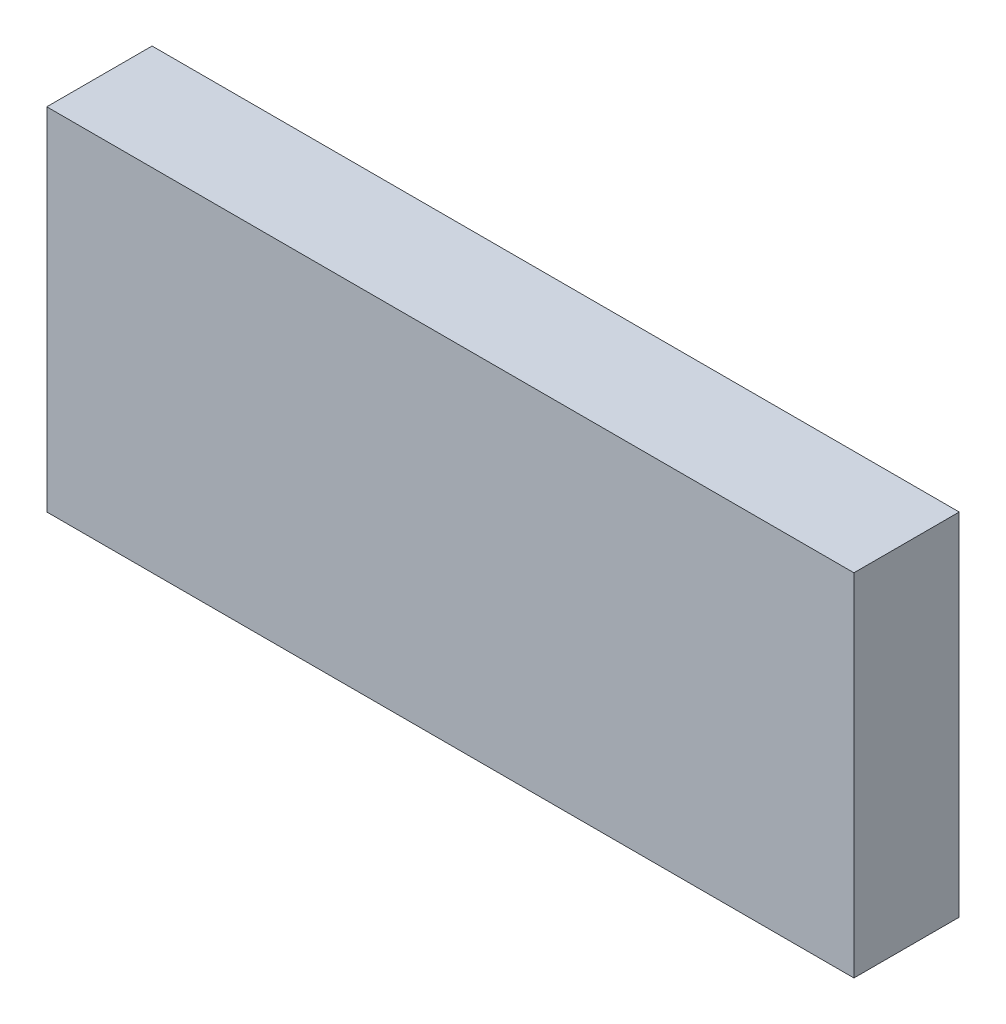
ISO-10303-21;
HEADER;
FILE_DESCRIPTION(('STEP AP214'),'2;1');
FILE_NAME('part.step','',(''),(''),'','','');
FILE_SCHEMA(('AUTOMOTIVE_DESIGN { 1 0 10303 214 1 1 1 1 }'));
ENDSEC;
DATA;
#1=APPLICATION_CONTEXT('core data for automotive mechanical design processes');
#2=APPLICATION_PROTOCOL_DEFINITION('international standard','automotive_design',2000,#1);
#3=PRODUCT_CONTEXT('',#1,'mechanical');
#4=PRODUCT('Part','Part','',(#3));
#5=PRODUCT_RELATED_PRODUCT_CATEGORY('part','',(#4));
#6=PRODUCT_DEFINITION_FORMATION('','',#4);
#7=PRODUCT_DEFINITION_CONTEXT('part definition',#1,'design');
#8=PRODUCT_DEFINITION('design','',#6,#7);
#9=PRODUCT_DEFINITION_SHAPE('','',#8);
#10=(LENGTH_UNIT() NAMED_UNIT(*) SI_UNIT(.MILLI.,.METRE.));
#11=(NAMED_UNIT(*) PLANE_ANGLE_UNIT() SI_UNIT($,.RADIAN.));
#12=(NAMED_UNIT(*) SI_UNIT($,.STERADIAN.) SOLID_ANGLE_UNIT());
#13=UNCERTAINTY_MEASURE_WITH_UNIT(LENGTH_MEASURE(1.E-05),#10,'distance_accuracy_value','');
#14=(GEOMETRIC_REPRESENTATION_CONTEXT(3) GLOBAL_UNCERTAINTY_ASSIGNED_CONTEXT((#13)) GLOBAL_UNIT_ASSIGNED_CONTEXT((#10,
#11,#12)) REPRESENTATION_CONTEXT('',''));
#15=CARTESIAN_POINT('',(0.,0.,0.));
#16=DIRECTION('',(0.,0.,1.));
#17=DIRECTION('',(1.,0.,0.));
#18=AXIS2_PLACEMENT_3D('',#15,#16,#17);
#19=CARTESIAN_POINT('',(-23.,10.,6.));
#20=DIRECTION('',(1.,0.,0.));
#21=DIRECTION('',(0.,1.,0.));
#22=AXIS2_PLACEMENT_3D('',#19,#20,#21);
#23=PLANE('',#22);
#24=DIRECTION('',(0.,-1.,0.));
#25=VECTOR('',#24,1.);
#26=CARTESIAN_POINT('',(-23.,10.,0.));
#27=LINE('',#26,#25);
#28=CARTESIAN_POINT('',(-23.,10.,0.));
#29=VERTEX_POINT('',#28);
#30=CARTESIAN_POINT('',(-23.,-10.,0.));
#31=VERTEX_POINT('',#30);
#32=EDGE_CURVE('E96',#29,#31,#27,.T.);
#33=ORIENTED_EDGE('',*,*,#32,.T.);
#34=DIRECTION('',(0.,0.,-1.));
#35=VECTOR('',#34,1.);
#36=CARTESIAN_POINT('',(-23.,-10.,6.));
#37=LINE('',#36,#35);
#38=CARTESIAN_POINT('',(-23.,-10.,6.));
#39=VERTEX_POINT('',#38);
#40=EDGE_CURVE('E11',#39,#31,#37,.T.);
#41=ORIENTED_EDGE('',*,*,#40,.F.);
#42=DIRECTION('',(0.,-1.,0.));
#43=VECTOR('',#42,1.);
#44=CARTESIAN_POINT('',(-23.,10.,6.));
#45=LINE('',#44,#43);
#46=CARTESIAN_POINT('',(-23.,10.,6.));
#47=VERTEX_POINT('',#46);
#48=EDGE_CURVE('E84',#47,#39,#45,.T.);
#49=ORIENTED_EDGE('',*,*,#48,.F.);
#50=DIRECTION('',(0.,0.,-1.));
#51=VECTOR('',#50,1.);
#52=CARTESIAN_POINT('',(-23.,10.,6.));
#53=LINE('',#52,#51);
#54=EDGE_CURVE('E92',#47,#29,#53,.T.);
#55=ORIENTED_EDGE('',*,*,#54,.T.);
#56=EDGE_LOOP('',(#33,#41,#49,#55));
#57=FACE_BOUND('',#56,.T.);
#58=ADVANCED_FACE('F33',(#57),#23,.F.);
#59=CARTESIAN_POINT('',(23.,-10.,6.));
#60=DIRECTION('',(0.,1.,0.));
#61=DIRECTION('',(-1.,0.,0.));
#62=AXIS2_PLACEMENT_3D('',#59,#60,#61);
#63=PLANE('',#62);
#64=DIRECTION('',(1.,0.,0.));
#65=VECTOR('',#64,1.);
#66=CARTESIAN_POINT('',(23.,-10.,0.));
#67=LINE('',#66,#65);
#68=CARTESIAN_POINT('',(23.,-10.,0.));
#69=VERTEX_POINT('',#68);
#70=EDGE_CURVE('E88',#31,#69,#67,.T.);
#71=ORIENTED_EDGE('',*,*,#70,.T.);
#72=DIRECTION('',(0.,0.,-1.));
#73=VECTOR('',#72,1.);
#74=CARTESIAN_POINT('',(23.,-10.,6.));
#75=LINE('',#74,#73);
#76=CARTESIAN_POINT('',(23.,-10.,6.));
#77=VERTEX_POINT('',#76);
#78=EDGE_CURVE('E41',#77,#69,#75,.T.);
#79=ORIENTED_EDGE('',*,*,#78,.F.);
#80=DIRECTION('',(1.,0.,0.));
#81=VECTOR('',#80,1.);
#82=CARTESIAN_POINT('',(23.,-10.,6.));
#83=LINE('',#82,#81);
#84=EDGE_CURVE('E79',#39,#77,#83,.T.);
#85=ORIENTED_EDGE('',*,*,#84,.F.);
#86=ORIENTED_EDGE('',*,*,#40,.T.);
#87=EDGE_LOOP('',(#71,#79,#85,#86));
#88=FACE_BOUND('',#87,.T.);
#89=ADVANCED_FACE('F87',(#88),#63,.F.);
#90=CARTESIAN_POINT('',(23.,10.,6.));
#91=DIRECTION('',(-1.,0.,0.));
#92=DIRECTION('',(0.,-1.,0.));
#93=AXIS2_PLACEMENT_3D('',#90,#91,#92);
#94=PLANE('',#93);
#95=DIRECTION('',(0.,1.,0.));
#96=VECTOR('',#95,1.);
#97=CARTESIAN_POINT('',(23.,10.,0.));
#98=LINE('',#97,#96);
#99=CARTESIAN_POINT('',(23.,10.,0.));
#100=VERTEX_POINT('',#99);
#101=EDGE_CURVE('E66',#69,#100,#98,.T.);
#102=ORIENTED_EDGE('',*,*,#101,.T.);
#103=DIRECTION('',(0.,0.,-1.));
#104=VECTOR('',#103,1.);
#105=CARTESIAN_POINT('',(23.,10.,6.));
#106=LINE('',#105,#104);
#107=CARTESIAN_POINT('',(23.,10.,6.));
#108=VERTEX_POINT('',#107);
#109=EDGE_CURVE('E89',#108,#100,#106,.T.);
#110=ORIENTED_EDGE('',*,*,#109,.F.);
#111=DIRECTION('',(0.,1.,0.));
#112=VECTOR('',#111,1.);
#113=CARTESIAN_POINT('',(23.,10.,6.));
#114=LINE('',#113,#112);
#115=EDGE_CURVE('E82',#77,#108,#114,.T.);
#116=ORIENTED_EDGE('',*,*,#115,.F.);
#117=ORIENTED_EDGE('',*,*,#78,.T.);
#118=EDGE_LOOP('',(#102,#110,#116,#117));
#119=FACE_BOUND('',#118,.T.);
#120=ADVANCED_FACE('F90',(#119),#94,.F.);
#121=CARTESIAN_POINT('',(23.,10.,6.));
#122=DIRECTION('',(0.,-1.,0.));
#123=DIRECTION('',(1.,0.,0.));
#124=AXIS2_PLACEMENT_3D('',#121,#122,#123);
#125=PLANE('',#124);
#126=DIRECTION('',(-1.,0.,0.));
#127=VECTOR('',#126,1.);
#128=CARTESIAN_POINT('',(23.,10.,0.));
#129=LINE('',#128,#127);
#130=EDGE_CURVE('E72',#100,#29,#129,.T.);
#131=ORIENTED_EDGE('',*,*,#130,.T.);
#132=ORIENTED_EDGE('',*,*,#54,.F.);
#133=DIRECTION('',(-1.,0.,0.));
#134=VECTOR('',#133,1.);
#135=CARTESIAN_POINT('',(23.,10.,6.));
#136=LINE('',#135,#134);
#137=EDGE_CURVE('E49',#108,#47,#136,.T.);
#138=ORIENTED_EDGE('',*,*,#137,.F.);
#139=ORIENTED_EDGE('',*,*,#109,.T.);
#140=EDGE_LOOP('',(#131,#132,#138,#139));
#141=FACE_BOUND('',#140,.T.);
#142=ADVANCED_FACE('F103',(#141),#125,.F.);
#143=CARTESIAN_POINT('',(0.,0.,6.));
#144=DIRECTION('',(0.,0.,-1.));
#145=DIRECTION('',(-1.,0.,0.));
#146=AXIS2_PLACEMENT_3D('',#143,#144,#145);
#147=PLANE('',#146);
#148=ORIENTED_EDGE('',*,*,#48,.T.);
#149=ORIENTED_EDGE('',*,*,#84,.T.);
#150=ORIENTED_EDGE('',*,*,#115,.T.);
#151=ORIENTED_EDGE('',*,*,#137,.T.);
#152=EDGE_LOOP('',(#148,#149,#150,#151));
#153=FACE_BOUND('',#152,.T.);
#154=ADVANCED_FACE('F80',(#153),#147,.F.);
#155=CARTESIAN_POINT('',(0.,0.,0.));
#156=DIRECTION('',(0.,0.,-1.));
#157=DIRECTION('',(-1.,0.,0.));
#158=AXIS2_PLACEMENT_3D('',#155,#156,#157);
#159=PLANE('',#158);
#160=ORIENTED_EDGE('',*,*,#32,.F.);
#161=ORIENTED_EDGE('',*,*,#130,.F.);
#162=ORIENTED_EDGE('',*,*,#101,.F.);
#163=ORIENTED_EDGE('',*,*,#70,.F.);
#164=EDGE_LOOP('',(#160,#161,#162,#163));
#165=FACE_BOUND('',#164,.T.);
#166=ADVANCED_FACE('F106',(#165),#159,.T.);
#167=CLOSED_SHELL('',(#58,#89,#120,#142,#154,#166));
#168=MANIFOLD_SOLID_BREP('B2',#167);
#169=ADVANCED_BREP_SHAPE_REPRESENTATION('',(#18,#168),#14);
#170=SHAPE_DEFINITION_REPRESENTATION(#9,#169);
ENDSEC;
END-ISO-10303-21;
